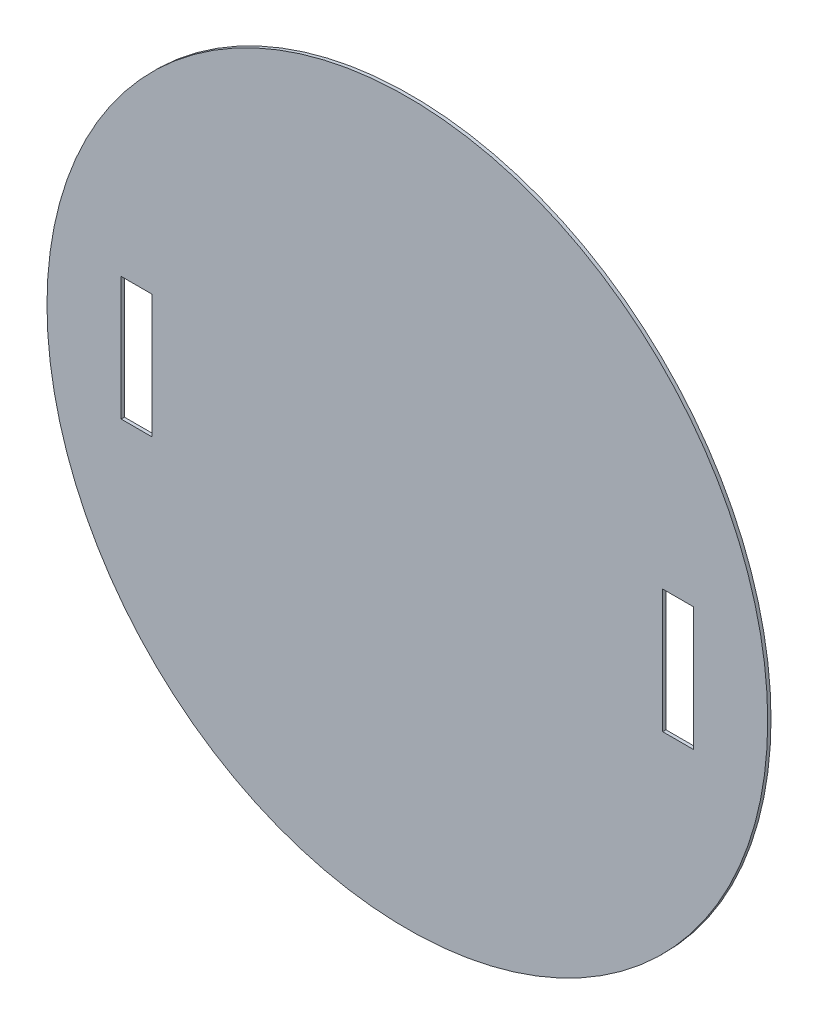
ISO-10303-21;
HEADER;
FILE_DESCRIPTION(('STEP AP214'),'2;1');
FILE_NAME('part.step','',(''),(''),'','','');
FILE_SCHEMA(('AUTOMOTIVE_DESIGN { 1 0 10303 214 1 1 1 1 }'));
ENDSEC;
DATA;
#1=APPLICATION_CONTEXT('core data for automotive mechanical design processes');
#2=APPLICATION_PROTOCOL_DEFINITION('international standard','automotive_design',2000,#1);
#3=PRODUCT_CONTEXT('',#1,'mechanical');
#4=PRODUCT('Part','Part','',(#3));
#5=PRODUCT_RELATED_PRODUCT_CATEGORY('part','',(#4));
#6=PRODUCT_DEFINITION_FORMATION('','',#4);
#7=PRODUCT_DEFINITION_CONTEXT('part definition',#1,'design');
#8=PRODUCT_DEFINITION('design','',#6,#7);
#9=PRODUCT_DEFINITION_SHAPE('','',#8);
#10=(LENGTH_UNIT() NAMED_UNIT(*) SI_UNIT(.MILLI.,.METRE.));
#11=(NAMED_UNIT(*) PLANE_ANGLE_UNIT() SI_UNIT($,.RADIAN.));
#12=(NAMED_UNIT(*) SI_UNIT($,.STERADIAN.) SOLID_ANGLE_UNIT());
#13=UNCERTAINTY_MEASURE_WITH_UNIT(LENGTH_MEASURE(1.E-05),#10,'distance_accuracy_value','');
#14=(GEOMETRIC_REPRESENTATION_CONTEXT(3) GLOBAL_UNCERTAINTY_ASSIGNED_CONTEXT((#13)) GLOBAL_UNIT_ASSIGNED_CONTEXT((#10,
#11,#12)) REPRESENTATION_CONTEXT('',''));
#15=CARTESIAN_POINT('',(0.,0.,0.));
#16=DIRECTION('',(0.,0.,1.));
#17=DIRECTION('',(1.,0.,0.));
#18=AXIS2_PLACEMENT_3D('',#15,#16,#17);
#19=CARTESIAN_POINT('',(0.,0.,1.6));
#20=DIRECTION('',(0.,0.,-1.));
#21=DIRECTION('',(-1.,0.,0.));
#22=AXIS2_PLACEMENT_3D('',#19,#20,#21);
#23=CYLINDRICAL_SURFACE('',#22,175.);
#24=CARTESIAN_POINT('',(0.,0.,1.6));
#25=DIRECTION('',(0.,0.,1.));
#26=DIRECTION('',(1.,0.,0.));
#27=AXIS2_PLACEMENT_3D('',#24,#25,#26);
#28=CIRCLE('',#27,175.);
#29=CARTESIAN_POINT('',(175.,0.,1.6));
#30=VERTEX_POINT('',#29);
#31=EDGE_CURVE('E11',#30,#30,#28,.T.);
#32=ORIENTED_EDGE('',*,*,#31,.F.);
#33=EDGE_LOOP('',(#32));
#34=FACE_BOUND('',#33,.T.);
#35=CARTESIAN_POINT('',(0.,0.,0.));
#36=DIRECTION('',(0.,0.,1.));
#37=DIRECTION('',(1.,0.,0.));
#38=AXIS2_PLACEMENT_3D('',#35,#36,#37);
#39=CIRCLE('',#38,175.);
#40=CARTESIAN_POINT('',(175.,0.,0.));
#41=VERTEX_POINT('',#40);
#42=EDGE_CURVE('E36',#41,#41,#39,.T.);
#43=ORIENTED_EDGE('',*,*,#42,.T.);
#44=EDGE_LOOP('',(#43));
#45=FACE_BOUND('',#44,.T.);
#46=ADVANCED_FACE('F33',(#34,#45),#23,.T.);
#47=CARTESIAN_POINT('',(0.,0.,1.6));
#48=DIRECTION('',(0.,0.,1.));
#49=DIRECTION('',(1.,0.,0.));
#50=AXIS2_PLACEMENT_3D('',#47,#48,#49);
#51=PLANE('',#50);
#52=DIRECTION('',(0.,-1.,0.));
#53=VECTOR('',#52,1.);
#54=CARTESIAN_POINT('',(-139.,30.,1.6));
#55=LINE('',#54,#53);
#56=CARTESIAN_POINT('',(-139.,30.,1.6));
#57=VERTEX_POINT('',#56);
#58=CARTESIAN_POINT('',(-139.,-30.,1.6));
#59=VERTEX_POINT('',#58);
#60=EDGE_CURVE('E47',#57,#59,#55,.T.);
#61=ORIENTED_EDGE('',*,*,#60,.F.);
#62=DIRECTION('',(-1.,0.,0.));
#63=VECTOR('',#62,1.);
#64=CARTESIAN_POINT('',(-139.,30.,1.6));
#65=LINE('',#64,#63);
#66=CARTESIAN_POINT('',(-124.,30.,1.6));
#67=VERTEX_POINT('',#66);
#68=EDGE_CURVE('E118',#67,#57,#65,.T.);
#69=ORIENTED_EDGE('',*,*,#68,.F.);
#70=DIRECTION('',(0.,1.,0.));
#71=VECTOR('',#70,1.);
#72=CARTESIAN_POINT('',(-124.,30.,1.6));
#73=LINE('',#72,#71);
#74=CARTESIAN_POINT('',(-124.,-30.,1.6));
#75=VERTEX_POINT('',#74);
#76=EDGE_CURVE('E121',#75,#67,#73,.T.);
#77=ORIENTED_EDGE('',*,*,#76,.F.);
#78=DIRECTION('',(1.,0.,0.));
#79=VECTOR('',#78,1.);
#80=CARTESIAN_POINT('',(-139.,-30.,1.6));
#81=LINE('',#80,#79);
#82=EDGE_CURVE('E127',#59,#75,#81,.T.);
#83=ORIENTED_EDGE('',*,*,#82,.F.);
#84=EDGE_LOOP('',(#61,#69,#77,#83));
#85=FACE_BOUND('',#84,.T.);
#86=DIRECTION('',(0.,1.,0.));
#87=VECTOR('',#86,1.);
#88=CARTESIAN_POINT('',(139.,30.,1.6));
#89=LINE('',#88,#87);
#90=CARTESIAN_POINT('',(139.,-30.,1.6));
#91=VERTEX_POINT('',#90);
#92=CARTESIAN_POINT('',(139.,30.,1.6));
#93=VERTEX_POINT('',#92);
#94=EDGE_CURVE('E55',#91,#93,#89,.T.);
#95=ORIENTED_EDGE('',*,*,#94,.F.);
#96=DIRECTION('',(1.,0.,0.));
#97=VECTOR('',#96,1.);
#98=CARTESIAN_POINT('',(139.,-30.,1.6));
#99=LINE('',#98,#97);
#100=CARTESIAN_POINT('',(124.,-30.,1.6));
#101=VERTEX_POINT('',#100);
#102=EDGE_CURVE('E141',#101,#91,#99,.T.);
#103=ORIENTED_EDGE('',*,*,#102,.F.);
#104=DIRECTION('',(0.,-1.,0.));
#105=VECTOR('',#104,1.);
#106=CARTESIAN_POINT('',(124.,30.,1.6));
#107=LINE('',#106,#105);
#108=CARTESIAN_POINT('',(124.,30.,1.6));
#109=VERTEX_POINT('',#108);
#110=EDGE_CURVE('E155',#109,#101,#107,.T.);
#111=ORIENTED_EDGE('',*,*,#110,.F.);
#112=DIRECTION('',(-1.,0.,0.));
#113=VECTOR('',#112,1.);
#114=CARTESIAN_POINT('',(139.,30.,1.6));
#115=LINE('',#114,#113);
#116=EDGE_CURVE('E152',#93,#109,#115,.T.);
#117=ORIENTED_EDGE('',*,*,#116,.F.);
#118=EDGE_LOOP('',(#95,#103,#111,#117));
#119=FACE_BOUND('',#118,.T.);
#120=ORIENTED_EDGE('',*,*,#31,.T.);
#121=EDGE_LOOP('',(#120));
#122=FACE_BOUND('',#121,.T.);
#123=ADVANCED_FACE('F173',(#85,#119,#122),#51,.T.);
#124=CARTESIAN_POINT('',(0.,0.,0.));
#125=DIRECTION('',(0.,0.,1.));
#126=DIRECTION('',(1.,0.,0.));
#127=AXIS2_PLACEMENT_3D('',#124,#125,#126);
#128=PLANE('',#127);
#129=DIRECTION('',(-1.,0.,0.));
#130=VECTOR('',#129,1.);
#131=CARTESIAN_POINT('',(-139.,30.,0.));
#132=LINE('',#131,#130);
#133=CARTESIAN_POINT('',(-124.,30.,0.));
#134=VERTEX_POINT('',#133);
#135=CARTESIAN_POINT('',(-139.,30.,0.));
#136=VERTEX_POINT('',#135);
#137=EDGE_CURVE('E105',#134,#136,#132,.T.);
#138=ORIENTED_EDGE('',*,*,#137,.T.);
#139=DIRECTION('',(0.,-1.,0.));
#140=VECTOR('',#139,1.);
#141=CARTESIAN_POINT('',(-139.,30.,0.));
#142=LINE('',#141,#140);
#143=CARTESIAN_POINT('',(-139.,-30.,0.));
#144=VERTEX_POINT('',#143);
#145=EDGE_CURVE('E99',#136,#144,#142,.T.);
#146=ORIENTED_EDGE('',*,*,#145,.T.);
#147=DIRECTION('',(1.,0.,0.));
#148=VECTOR('',#147,1.);
#149=CARTESIAN_POINT('',(-139.,-30.,0.));
#150=LINE('',#149,#148);
#151=CARTESIAN_POINT('',(-124.,-30.,0.));
#152=VERTEX_POINT('',#151);
#153=EDGE_CURVE('E109',#144,#152,#150,.T.);
#154=ORIENTED_EDGE('',*,*,#153,.T.);
#155=DIRECTION('',(0.,1.,0.));
#156=VECTOR('',#155,1.);
#157=CARTESIAN_POINT('',(-124.,30.,0.));
#158=LINE('',#157,#156);
#159=EDGE_CURVE('E113',#152,#134,#158,.T.);
#160=ORIENTED_EDGE('',*,*,#159,.T.);
#161=EDGE_LOOP('',(#138,#146,#154,#160));
#162=FACE_BOUND('',#161,.T.);
#163=DIRECTION('',(1.,0.,0.));
#164=VECTOR('',#163,1.);
#165=CARTESIAN_POINT('',(139.,-30.,0.));
#166=LINE('',#165,#164);
#167=CARTESIAN_POINT('',(124.,-30.,0.));
#168=VERTEX_POINT('',#167);
#169=CARTESIAN_POINT('',(139.,-30.,0.));
#170=VERTEX_POINT('',#169);
#171=EDGE_CURVE('E147',#168,#170,#166,.T.);
#172=ORIENTED_EDGE('',*,*,#171,.T.);
#173=DIRECTION('',(0.,1.,0.));
#174=VECTOR('',#173,1.);
#175=CARTESIAN_POINT('',(139.,30.,0.));
#176=LINE('',#175,#174);
#177=CARTESIAN_POINT('',(139.,30.,0.));
#178=VERTEX_POINT('',#177);
#179=EDGE_CURVE('E137',#170,#178,#176,.T.);
#180=ORIENTED_EDGE('',*,*,#179,.T.);
#181=DIRECTION('',(-1.,0.,0.));
#182=VECTOR('',#181,1.);
#183=CARTESIAN_POINT('',(139.,30.,0.));
#184=LINE('',#183,#182);
#185=CARTESIAN_POINT('',(124.,30.,0.));
#186=VERTEX_POINT('',#185);
#187=EDGE_CURVE('E140',#178,#186,#184,.T.);
#188=ORIENTED_EDGE('',*,*,#187,.T.);
#189=DIRECTION('',(0.,-1.,0.));
#190=VECTOR('',#189,1.);
#191=CARTESIAN_POINT('',(124.,30.,0.));
#192=LINE('',#191,#190);
#193=EDGE_CURVE('E144',#186,#168,#192,.T.);
#194=ORIENTED_EDGE('',*,*,#193,.T.);
#195=EDGE_LOOP('',(#172,#180,#188,#194));
#196=FACE_BOUND('',#195,.T.);
#197=ORIENTED_EDGE('',*,*,#42,.F.);
#198=EDGE_LOOP('',(#197));
#199=FACE_BOUND('',#198,.T.);
#200=ADVANCED_FACE('F115',(#162,#196,#199),#128,.F.);
#201=CARTESIAN_POINT('',(139.,30.,0.));
#202=DIRECTION('',(1.,0.,0.));
#203=DIRECTION('',(0.,0.,-1.));
#204=AXIS2_PLACEMENT_3D('',#201,#202,#203);
#205=PLANE('',#204);
#206=ORIENTED_EDGE('',*,*,#94,.T.);
#207=DIRECTION('',(0.,0.,1.));
#208=VECTOR('',#207,1.);
#209=CARTESIAN_POINT('',(139.,30.,0.));
#210=LINE('',#209,#208);
#211=EDGE_CURVE('E150',#178,#93,#210,.T.);
#212=ORIENTED_EDGE('',*,*,#211,.F.);
#213=ORIENTED_EDGE('',*,*,#179,.F.);
#214=DIRECTION('',(0.,0.,1.));
#215=VECTOR('',#214,1.);
#216=CARTESIAN_POINT('',(139.,-30.,0.));
#217=LINE('',#216,#215);
#218=EDGE_CURVE('E128',#170,#91,#217,.T.);
#219=ORIENTED_EDGE('',*,*,#218,.T.);
#220=EDGE_LOOP('',(#206,#212,#213,#219));
#221=FACE_BOUND('',#220,.T.);
#222=ADVANCED_FACE('F180',(#221),#205,.F.);
#223=CARTESIAN_POINT('',(139.,-30.,0.));
#224=DIRECTION('',(0.,-1.,0.));
#225=DIRECTION('',(0.,0.,-1.));
#226=AXIS2_PLACEMENT_3D('',#223,#224,#225);
#227=PLANE('',#226);
#228=ORIENTED_EDGE('',*,*,#102,.T.);
#229=ORIENTED_EDGE('',*,*,#218,.F.);
#230=ORIENTED_EDGE('',*,*,#171,.F.);
#231=DIRECTION('',(0.,0.,1.));
#232=VECTOR('',#231,1.);
#233=CARTESIAN_POINT('',(124.,-30.,0.));
#234=LINE('',#233,#232);
#235=EDGE_CURVE('E161',#168,#101,#234,.T.);
#236=ORIENTED_EDGE('',*,*,#235,.T.);
#237=EDGE_LOOP('',(#228,#229,#230,#236));
#238=FACE_BOUND('',#237,.T.);
#239=ADVANCED_FACE('F182',(#238),#227,.F.);
#240=CARTESIAN_POINT('',(124.,30.,0.));
#241=DIRECTION('',(-1.,0.,0.));
#242=DIRECTION('',(0.,0.,1.));
#243=AXIS2_PLACEMENT_3D('',#240,#241,#242);
#244=PLANE('',#243);
#245=ORIENTED_EDGE('',*,*,#110,.T.);
#246=ORIENTED_EDGE('',*,*,#235,.F.);
#247=ORIENTED_EDGE('',*,*,#193,.F.);
#248=DIRECTION('',(0.,0.,1.));
#249=VECTOR('',#248,1.);
#250=CARTESIAN_POINT('',(124.,30.,0.));
#251=LINE('',#250,#249);
#252=EDGE_CURVE('E163',#186,#109,#251,.T.);
#253=ORIENTED_EDGE('',*,*,#252,.T.);
#254=EDGE_LOOP('',(#245,#246,#247,#253));
#255=FACE_BOUND('',#254,.T.);
#256=ADVANCED_FACE('F177',(#255),#244,.F.);
#257=CARTESIAN_POINT('',(139.,30.,0.));
#258=DIRECTION('',(0.,1.,0.));
#259=DIRECTION('',(0.,0.,1.));
#260=AXIS2_PLACEMENT_3D('',#257,#258,#259);
#261=PLANE('',#260);
#262=ORIENTED_EDGE('',*,*,#116,.T.);
#263=ORIENTED_EDGE('',*,*,#252,.F.);
#264=ORIENTED_EDGE('',*,*,#187,.F.);
#265=ORIENTED_EDGE('',*,*,#211,.T.);
#266=EDGE_LOOP('',(#262,#263,#264,#265));
#267=FACE_BOUND('',#266,.T.);
#268=ADVANCED_FACE('F168',(#267),#261,.F.);
#269=CARTESIAN_POINT('',(-139.,30.,0.));
#270=DIRECTION('',(-1.,0.,0.));
#271=DIRECTION('',(0.,0.,1.));
#272=AXIS2_PLACEMENT_3D('',#269,#270,#271);
#273=PLANE('',#272);
#274=ORIENTED_EDGE('',*,*,#60,.T.);
#275=DIRECTION('',(0.,0.,1.));
#276=VECTOR('',#275,1.);
#277=CARTESIAN_POINT('',(-139.,-30.,0.));
#278=LINE('',#277,#276);
#279=EDGE_CURVE('E95',#144,#59,#278,.T.);
#280=ORIENTED_EDGE('',*,*,#279,.F.);
#281=ORIENTED_EDGE('',*,*,#145,.F.);
#282=DIRECTION('',(0.,0.,1.));
#283=VECTOR('',#282,1.);
#284=CARTESIAN_POINT('',(-139.,30.,0.));
#285=LINE('',#284,#283);
#286=EDGE_CURVE('E132',#136,#57,#285,.T.);
#287=ORIENTED_EDGE('',*,*,#286,.T.);
#288=EDGE_LOOP('',(#274,#280,#281,#287));
#289=FACE_BOUND('',#288,.T.);
#290=ADVANCED_FACE('F97',(#289),#273,.F.);
#291=CARTESIAN_POINT('',(-139.,30.,0.));
#292=DIRECTION('',(0.,1.,0.));
#293=DIRECTION('',(0.,0.,1.));
#294=AXIS2_PLACEMENT_3D('',#291,#292,#293);
#295=PLANE('',#294);
#296=ORIENTED_EDGE('',*,*,#68,.T.);
#297=ORIENTED_EDGE('',*,*,#286,.F.);
#298=ORIENTED_EDGE('',*,*,#137,.F.);
#299=DIRECTION('',(0.,0.,1.));
#300=VECTOR('',#299,1.);
#301=CARTESIAN_POINT('',(-124.,30.,0.));
#302=LINE('',#301,#300);
#303=EDGE_CURVE('E134',#134,#67,#302,.T.);
#304=ORIENTED_EDGE('',*,*,#303,.T.);
#305=EDGE_LOOP('',(#296,#297,#298,#304));
#306=FACE_BOUND('',#305,.T.);
#307=ADVANCED_FACE('F211',(#306),#295,.F.);
#308=CARTESIAN_POINT('',(-124.,30.,0.));
#309=DIRECTION('',(1.,0.,0.));
#310=DIRECTION('',(0.,0.,-1.));
#311=AXIS2_PLACEMENT_3D('',#308,#309,#310);
#312=PLANE('',#311);
#313=ORIENTED_EDGE('',*,*,#76,.T.);
#314=ORIENTED_EDGE('',*,*,#303,.F.);
#315=ORIENTED_EDGE('',*,*,#159,.F.);
#316=DIRECTION('',(0.,0.,1.));
#317=VECTOR('',#316,1.);
#318=CARTESIAN_POINT('',(-124.,-30.,0.));
#319=LINE('',#318,#317);
#320=EDGE_CURVE('E104',#152,#75,#319,.T.);
#321=ORIENTED_EDGE('',*,*,#320,.T.);
#322=EDGE_LOOP('',(#313,#314,#315,#321));
#323=FACE_BOUND('',#322,.T.);
#324=ADVANCED_FACE('F215',(#323),#312,.F.);
#325=CARTESIAN_POINT('',(-139.,-30.,0.));
#326=DIRECTION('',(0.,-1.,0.));
#327=DIRECTION('',(0.,0.,-1.));
#328=AXIS2_PLACEMENT_3D('',#325,#326,#327);
#329=PLANE('',#328);
#330=ORIENTED_EDGE('',*,*,#82,.T.);
#331=ORIENTED_EDGE('',*,*,#320,.F.);
#332=ORIENTED_EDGE('',*,*,#153,.F.);
#333=ORIENTED_EDGE('',*,*,#279,.T.);
#334=EDGE_LOOP('',(#330,#331,#332,#333));
#335=FACE_BOUND('',#334,.T.);
#336=ADVANCED_FACE('F110',(#335),#329,.F.);
#337=CLOSED_SHELL('',(#46,#123,#200,#222,#239,#256,#268,#290,#307,#324,#336));
#338=MANIFOLD_SOLID_BREP('B2',#337);
#339=ADVANCED_BREP_SHAPE_REPRESENTATION('',(#18,#338),#14);
#340=SHAPE_DEFINITION_REPRESENTATION(#9,#339);
ENDSEC;
END-ISO-10303-21;
